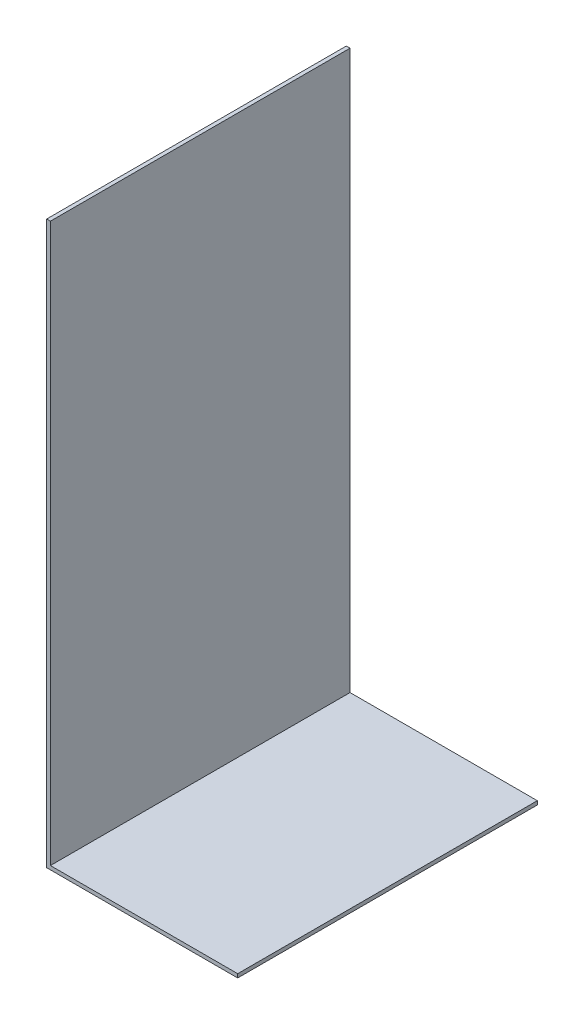
ISO-10303-21;
HEADER;
FILE_DESCRIPTION(('STEP AP214'),'2;1');
FILE_NAME('part.step','',(''),(''),'','','');
FILE_SCHEMA(('AUTOMOTIVE_DESIGN { 1 0 10303 214 1 1 1 1 }'));
ENDSEC;
DATA;
#1=APPLICATION_CONTEXT('core data for automotive mechanical design processes');
#2=APPLICATION_PROTOCOL_DEFINITION('international standard','automotive_design',2000,#1);
#3=PRODUCT_CONTEXT('',#1,'mechanical');
#4=PRODUCT('Part','Part','',(#3));
#5=PRODUCT_RELATED_PRODUCT_CATEGORY('part','',(#4));
#6=PRODUCT_DEFINITION_FORMATION('','',#4);
#7=PRODUCT_DEFINITION_CONTEXT('part definition',#1,'design');
#8=PRODUCT_DEFINITION('design','',#6,#7);
#9=PRODUCT_DEFINITION_SHAPE('','',#8);
#10=(LENGTH_UNIT() NAMED_UNIT(*) SI_UNIT(.MILLI.,.METRE.));
#11=(NAMED_UNIT(*) PLANE_ANGLE_UNIT() SI_UNIT($,.RADIAN.));
#12=(NAMED_UNIT(*) SI_UNIT($,.STERADIAN.) SOLID_ANGLE_UNIT());
#13=UNCERTAINTY_MEASURE_WITH_UNIT(LENGTH_MEASURE(1.E-05),#10,'distance_accuracy_value','');
#14=(GEOMETRIC_REPRESENTATION_CONTEXT(3) GLOBAL_UNCERTAINTY_ASSIGNED_CONTEXT((#13)) GLOBAL_UNIT_ASSIGNED_CONTEXT((#10,
#11,#12)) REPRESENTATION_CONTEXT('',''));
#15=CARTESIAN_POINT('',(0.,0.,0.));
#16=DIRECTION('',(0.,0.,1.));
#17=DIRECTION('',(1.,0.,0.));
#18=AXIS2_PLACEMENT_3D('',#15,#16,#17);
#19=CARTESIAN_POINT('',(25.,1.,-40.));
#20=DIRECTION('',(-1.,0.,0.));
#21=DIRECTION('',(0.,0.,1.));
#22=AXIS2_PLACEMENT_3D('',#19,#20,#21);
#23=PLANE('',#22);
#24=DIRECTION('',(0.,0.,-1.));
#25=VECTOR('',#24,1.);
#26=CARTESIAN_POINT('',(25.,0.,-40.));
#27=LINE('',#26,#25);
#28=CARTESIAN_POINT('',(25.,0.,40.));
#29=VERTEX_POINT('',#28);
#30=CARTESIAN_POINT('',(25.,0.,-40.));
#31=VERTEX_POINT('',#30);
#32=EDGE_CURVE('E94',#29,#31,#27,.T.);
#33=ORIENTED_EDGE('',*,*,#32,.T.);
#34=DIRECTION('',(0.,-1.,0.));
#35=VECTOR('',#34,1.);
#36=CARTESIAN_POINT('',(25.,1.,-40.));
#37=LINE('',#36,#35);
#38=CARTESIAN_POINT('',(25.,1.,-40.));
#39=VERTEX_POINT('',#38);
#40=EDGE_CURVE('E11',#39,#31,#37,.T.);
#41=ORIENTED_EDGE('',*,*,#40,.F.);
#42=DIRECTION('',(0.,0.,-1.));
#43=VECTOR('',#42,1.);
#44=CARTESIAN_POINT('',(25.,1.,-40.));
#45=LINE('',#44,#43);
#46=CARTESIAN_POINT('',(25.,1.,40.));
#47=VERTEX_POINT('',#46);
#48=EDGE_CURVE('E86',#47,#39,#45,.T.);
#49=ORIENTED_EDGE('',*,*,#48,.F.);
#50=DIRECTION('',(0.,-1.,0.));
#51=VECTOR('',#50,1.);
#52=CARTESIAN_POINT('',(25.,1.,40.));
#53=LINE('',#52,#51);
#54=EDGE_CURVE('E41',#47,#29,#53,.T.);
#55=ORIENTED_EDGE('',*,*,#54,.T.);
#56=EDGE_LOOP('',(#33,#41,#49,#55));
#57=FACE_BOUND('',#56,.T.);
#58=ADVANCED_FACE('F33',(#57),#23,.F.);
#59=CARTESIAN_POINT('',(-25.,1.,-40.));
#60=DIRECTION('',(0.,0.,1.));
#61=DIRECTION('',(1.,0.,0.));
#62=AXIS2_PLACEMENT_3D('',#59,#60,#61);
#63=PLANE('',#62);
#64=DIRECTION('',(-1.,0.,0.));
#65=VECTOR('',#64,1.);
#66=CARTESIAN_POINT('',(-25.,0.,-40.));
#67=LINE('',#66,#65);
#68=CARTESIAN_POINT('',(-26.,0.,-40.));
#69=VERTEX_POINT('',#68);
#70=EDGE_CURVE('E62',#31,#69,#67,.T.);
#71=ORIENTED_EDGE('',*,*,#70,.T.);
#72=DIRECTION('',(0.,-1.,0.));
#73=VECTOR('',#72,1.);
#74=CARTESIAN_POINT('',(-26.,0.,-40.));
#75=LINE('',#74,#73);
#76=CARTESIAN_POINT('',(-26.,150.,-40.));
#77=VERTEX_POINT('',#76);
#78=EDGE_CURVE('E117',#77,#69,#75,.T.);
#79=ORIENTED_EDGE('',*,*,#78,.F.);
#80=DIRECTION('',(1.,0.,0.));
#81=VECTOR('',#80,1.);
#82=CARTESIAN_POINT('',(-26.,150.,-40.));
#83=LINE('',#82,#81);
#84=CARTESIAN_POINT('',(-25.,150.,-40.));
#85=VERTEX_POINT('',#84);
#86=EDGE_CURVE('E99',#77,#85,#83,.T.);
#87=ORIENTED_EDGE('',*,*,#86,.T.);
#88=DIRECTION('',(0.,-1.,0.));
#89=VECTOR('',#88,1.);
#90=CARTESIAN_POINT('',(-25.,0.,-40.));
#91=LINE('',#90,#89);
#92=CARTESIAN_POINT('',(-25.,1.,-40.));
#93=VERTEX_POINT('',#92);
#94=EDGE_CURVE('E85',#85,#93,#91,.T.);
#95=ORIENTED_EDGE('',*,*,#94,.T.);
#96=DIRECTION('',(-1.,0.,0.));
#97=VECTOR('',#96,1.);
#98=CARTESIAN_POINT('',(-25.,1.,-40.));
#99=LINE('',#98,#97);
#100=EDGE_CURVE('E80',#39,#93,#99,.T.);
#101=ORIENTED_EDGE('',*,*,#100,.F.);
#102=ORIENTED_EDGE('',*,*,#40,.T.);
#103=EDGE_LOOP('',(#71,#79,#87,#95,#101,#102));
#104=FACE_BOUND('',#103,.T.);
#105=ADVANCED_FACE('F81',(#104),#63,.F.);
#106=CARTESIAN_POINT('',(-25.,1.,40.));
#107=DIRECTION('',(0.,0.,-1.));
#108=DIRECTION('',(-1.,0.,0.));
#109=AXIS2_PLACEMENT_3D('',#106,#107,#108);
#110=PLANE('',#109);
#111=DIRECTION('',(1.,0.,0.));
#112=VECTOR('',#111,1.);
#113=CARTESIAN_POINT('',(-25.,0.,40.));
#114=LINE('',#113,#112);
#115=CARTESIAN_POINT('',(-26.,0.,40.));
#116=VERTEX_POINT('',#115);
#117=EDGE_CURVE('E92',#116,#29,#114,.T.);
#118=ORIENTED_EDGE('',*,*,#117,.T.);
#119=ORIENTED_EDGE('',*,*,#54,.F.);
#120=DIRECTION('',(1.,0.,0.));
#121=VECTOR('',#120,1.);
#122=CARTESIAN_POINT('',(-25.,1.,40.));
#123=LINE('',#122,#121);
#124=CARTESIAN_POINT('',(-25.,1.,40.));
#125=VERTEX_POINT('',#124);
#126=EDGE_CURVE('E49',#125,#47,#123,.T.);
#127=ORIENTED_EDGE('',*,*,#126,.F.);
#128=DIRECTION('',(0.,1.,0.));
#129=VECTOR('',#128,1.);
#130=CARTESIAN_POINT('',(-25.,0.,40.));
#131=LINE('',#130,#129);
#132=CARTESIAN_POINT('',(-25.,150.,40.));
#133=VERTEX_POINT('',#132);
#134=EDGE_CURVE('E112',#125,#133,#131,.T.);
#135=ORIENTED_EDGE('',*,*,#134,.T.);
#136=DIRECTION('',(1.,0.,0.));
#137=VECTOR('',#136,1.);
#138=CARTESIAN_POINT('',(-26.,150.,40.));
#139=LINE('',#138,#137);
#140=CARTESIAN_POINT('',(-26.,150.,40.));
#141=VERTEX_POINT('',#140);
#142=EDGE_CURVE('E95',#141,#133,#139,.T.);
#143=ORIENTED_EDGE('',*,*,#142,.F.);
#144=DIRECTION('',(0.,1.,0.));
#145=VECTOR('',#144,1.);
#146=CARTESIAN_POINT('',(-26.,0.,40.));
#147=LINE('',#146,#145);
#148=EDGE_CURVE('E108',#116,#141,#147,.T.);
#149=ORIENTED_EDGE('',*,*,#148,.F.);
#150=EDGE_LOOP('',(#118,#119,#127,#135,#143,#149));
#151=FACE_BOUND('',#150,.T.);
#152=ADVANCED_FACE('F134',(#151),#110,.F.);
#153=CARTESIAN_POINT('',(0.,1.,0.));
#154=DIRECTION('',(0.,1.,0.));
#155=DIRECTION('',(0.,0.,1.));
#156=AXIS2_PLACEMENT_3D('',#153,#154,#155);
#157=PLANE('',#156);
#158=ORIENTED_EDGE('',*,*,#48,.T.);
#159=ORIENTED_EDGE('',*,*,#100,.T.);
#160=DIRECTION('',(0.,0.,1.));
#161=VECTOR('',#160,1.);
#162=CARTESIAN_POINT('',(-25.,1.,-40.));
#163=LINE('',#162,#161);
#164=EDGE_CURVE('E69',#93,#125,#163,.T.);
#165=ORIENTED_EDGE('',*,*,#164,.T.);
#166=ORIENTED_EDGE('',*,*,#126,.T.);
#167=EDGE_LOOP('',(#158,#159,#165,#166));
#168=FACE_BOUND('',#167,.T.);
#169=ADVANCED_FACE('F89',(#168),#157,.T.);
#170=CARTESIAN_POINT('',(0.,0.,0.));
#171=DIRECTION('',(0.,1.,0.));
#172=DIRECTION('',(0.,0.,1.));
#173=AXIS2_PLACEMENT_3D('',#170,#171,#172);
#174=PLANE('',#173);
#175=ORIENTED_EDGE('',*,*,#32,.F.);
#176=ORIENTED_EDGE('',*,*,#117,.F.);
#177=DIRECTION('',(0.,0.,1.));
#178=VECTOR('',#177,1.);
#179=CARTESIAN_POINT('',(-26.,0.,40.));
#180=LINE('',#179,#178);
#181=EDGE_CURVE('E106',#69,#116,#180,.T.);
#182=ORIENTED_EDGE('',*,*,#181,.F.);
#183=ORIENTED_EDGE('',*,*,#70,.F.);
#184=EDGE_LOOP('',(#175,#176,#182,#183));
#185=FACE_BOUND('',#184,.T.);
#186=ADVANCED_FACE('F142',(#185),#174,.F.);
#187=CARTESIAN_POINT('',(-26.,150.,40.));
#188=DIRECTION('',(0.,-1.,0.));
#189=DIRECTION('',(0.,0.,-1.));
#190=AXIS2_PLACEMENT_3D('',#187,#188,#189);
#191=PLANE('',#190);
#192=DIRECTION('',(0.,0.,-1.));
#193=VECTOR('',#192,1.);
#194=CARTESIAN_POINT('',(-25.,150.,40.));
#195=LINE('',#194,#193);
#196=EDGE_CURVE('E109',#133,#85,#195,.T.);
#197=ORIENTED_EDGE('',*,*,#196,.T.);
#198=ORIENTED_EDGE('',*,*,#86,.F.);
#199=DIRECTION('',(0.,0.,-1.));
#200=VECTOR('',#199,1.);
#201=CARTESIAN_POINT('',(-26.,150.,40.));
#202=LINE('',#201,#200);
#203=EDGE_CURVE('E120',#141,#77,#202,.T.);
#204=ORIENTED_EDGE('',*,*,#203,.F.);
#205=ORIENTED_EDGE('',*,*,#142,.T.);
#206=EDGE_LOOP('',(#197,#198,#204,#205));
#207=FACE_BOUND('',#206,.T.);
#208=ADVANCED_FACE('F138',(#207),#191,.F.);
#209=CARTESIAN_POINT('',(-26.,0.,0.));
#210=DIRECTION('',(-1.,0.,0.));
#211=DIRECTION('',(0.,0.,1.));
#212=AXIS2_PLACEMENT_3D('',#209,#210,#211);
#213=PLANE('',#212);
#214=ORIENTED_EDGE('',*,*,#148,.T.);
#215=ORIENTED_EDGE('',*,*,#203,.T.);
#216=ORIENTED_EDGE('',*,*,#78,.T.);
#217=ORIENTED_EDGE('',*,*,#181,.T.);
#218=EDGE_LOOP('',(#214,#215,#216,#217));
#219=FACE_BOUND('',#218,.T.);
#220=ADVANCED_FACE('F128',(#219),#213,.T.);
#221=CARTESIAN_POINT('',(-25.,0.,0.));
#222=DIRECTION('',(-1.,0.,0.));
#223=DIRECTION('',(0.,0.,1.));
#224=AXIS2_PLACEMENT_3D('',#221,#222,#223);
#225=PLANE('',#224);
#226=ORIENTED_EDGE('',*,*,#164,.F.);
#227=ORIENTED_EDGE('',*,*,#94,.F.);
#228=ORIENTED_EDGE('',*,*,#196,.F.);
#229=ORIENTED_EDGE('',*,*,#134,.F.);
#230=EDGE_LOOP('',(#226,#227,#228,#229));
#231=FACE_BOUND('',#230,.T.);
#232=ADVANCED_FACE('F186',(#231),#225,.F.);
#233=CLOSED_SHELL('',(#58,#105,#152,#169,#186,#208,#220,#232));
#234=MANIFOLD_SOLID_BREP('B2',#233);
#235=ADVANCED_BREP_SHAPE_REPRESENTATION('',(#18,#234),#14);
#236=SHAPE_DEFINITION_REPRESENTATION(#9,#235);
ENDSEC;
END-ISO-10303-21;
